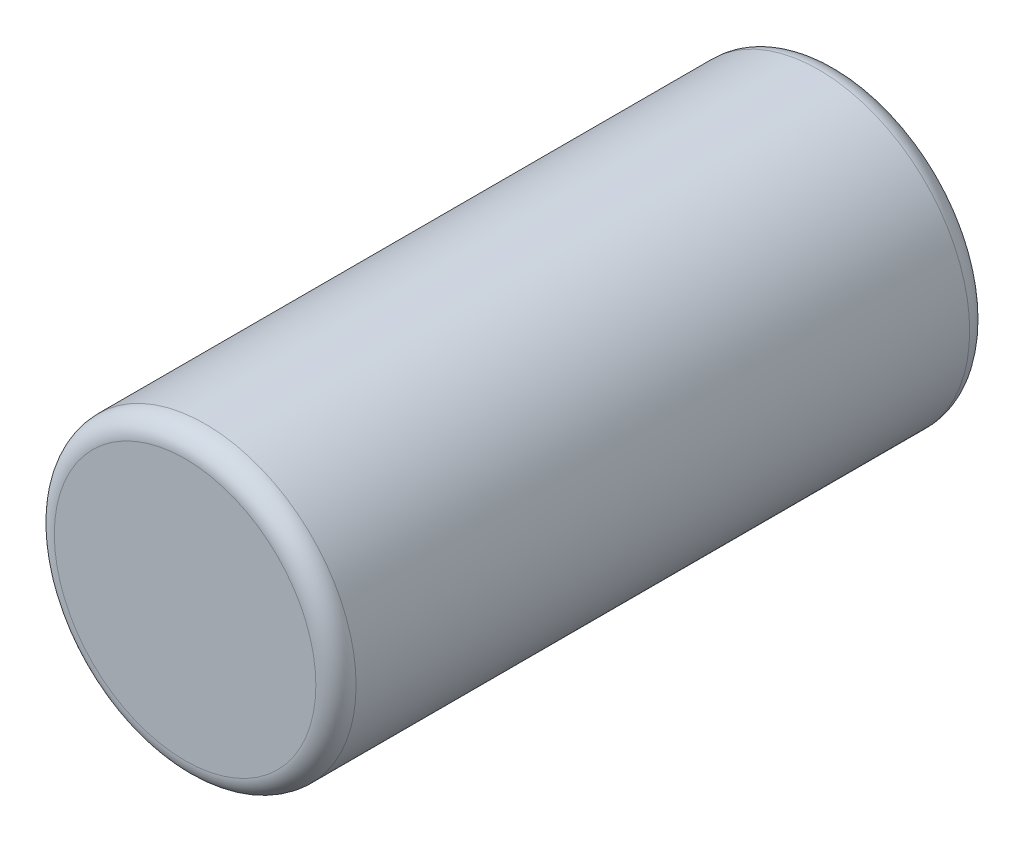
ISO-10303-21;
HEADER;
FILE_DESCRIPTION(('STEP AP214'),'2;1');
FILE_NAME('part.step','',(''),(''),'','','');
FILE_SCHEMA(('AUTOMOTIVE_DESIGN { 1 0 10303 214 1 1 1 1 }'));
ENDSEC;
DATA;
#1=APPLICATION_CONTEXT('core data for automotive mechanical design processes');
#2=APPLICATION_PROTOCOL_DEFINITION('international standard','automotive_design',2000,#1);
#3=PRODUCT_CONTEXT('',#1,'mechanical');
#4=PRODUCT('Part','Part','',(#3));
#5=PRODUCT_RELATED_PRODUCT_CATEGORY('part','',(#4));
#6=PRODUCT_DEFINITION_FORMATION('','',#4);
#7=PRODUCT_DEFINITION_CONTEXT('part definition',#1,'design');
#8=PRODUCT_DEFINITION('design','',#6,#7);
#9=PRODUCT_DEFINITION_SHAPE('','',#8);
#10=(LENGTH_UNIT() NAMED_UNIT(*) SI_UNIT(.MILLI.,.METRE.));
#11=(NAMED_UNIT(*) PLANE_ANGLE_UNIT() SI_UNIT($,.RADIAN.));
#12=(NAMED_UNIT(*) SI_UNIT($,.STERADIAN.) SOLID_ANGLE_UNIT());
#13=UNCERTAINTY_MEASURE_WITH_UNIT(LENGTH_MEASURE(1.E-05),#10,'distance_accuracy_value','');
#14=(GEOMETRIC_REPRESENTATION_CONTEXT(3) GLOBAL_UNCERTAINTY_ASSIGNED_CONTEXT((#13)) GLOBAL_UNIT_ASSIGNED_CONTEXT((#10,
#11,#12)) REPRESENTATION_CONTEXT('',''));
#15=CARTESIAN_POINT('',(0.,0.,0.));
#16=DIRECTION('',(0.,0.,1.));
#17=DIRECTION('',(1.,0.,0.));
#18=AXIS2_PLACEMENT_3D('',#15,#16,#17);
#19=CARTESIAN_POINT('',(0.,0.,6.5));
#20=DIRECTION('',(0.,0.,-1.));
#21=DIRECTION('',(-1.,0.,0.));
#22=AXIS2_PLACEMENT_3D('',#19,#20,#21);
#23=CYLINDRICAL_SURFACE('',#22,1.5);
#24=CARTESIAN_POINT('',(0.,0.,0.2));
#25=DIRECTION('',(0.,0.,1.));
#26=DIRECTION('',(1.,0.,0.));
#27=AXIS2_PLACEMENT_3D('',#24,#25,#26);
#28=CIRCLE('',#27,1.5);
#29=CARTESIAN_POINT('',(1.5,0.,0.2));
#30=VERTEX_POINT('',#29);
#31=EDGE_CURVE('E48',#30,#30,#28,.T.);
#32=ORIENTED_EDGE('',*,*,#31,.T.);
#33=EDGE_LOOP('',(#32));
#34=FACE_BOUND('',#33,.T.);
#35=CARTESIAN_POINT('',(0.,0.,6.3));
#36=DIRECTION('',(0.,0.,1.));
#37=DIRECTION('',(1.,0.,0.));
#38=AXIS2_PLACEMENT_3D('',#35,#36,#37);
#39=CIRCLE('',#38,1.5);
#40=CARTESIAN_POINT('',(1.5,0.,6.3));
#41=VERTEX_POINT('',#40);
#42=EDGE_CURVE('E52',#41,#41,#39,.F.);
#43=ORIENTED_EDGE('',*,*,#42,.T.);
#44=EDGE_LOOP('',(#43));
#45=FACE_BOUND('',#44,.T.);
#46=ADVANCED_FACE('F37',(#34,#45),#23,.T.);
#47=CARTESIAN_POINT('',(0.,0.,6.5));
#48=DIRECTION('',(0.,0.,1.));
#49=DIRECTION('',(1.,0.,0.));
#50=AXIS2_PLACEMENT_3D('',#47,#48,#49);
#51=PLANE('',#50);
#52=CARTESIAN_POINT('',(0.,0.,6.5));
#53=DIRECTION('',(0.,0.,1.));
#54=DIRECTION('',(1.,0.,0.));
#55=AXIS2_PLACEMENT_3D('',#52,#53,#54);
#56=CIRCLE('',#55,1.3);
#57=CARTESIAN_POINT('',(1.3,0.,6.5));
#58=VERTEX_POINT('',#57);
#59=EDGE_CURVE('E10',#58,#58,#56,.T.);
#60=ORIENTED_EDGE('',*,*,#59,.T.);
#61=EDGE_LOOP('',(#60));
#62=FACE_BOUND('',#61,.T.);
#63=ADVANCED_FACE('F68',(#62),#51,.T.);
#64=CARTESIAN_POINT('',(0.,0.,0.));
#65=DIRECTION('',(0.,0.,1.));
#66=DIRECTION('',(1.,0.,0.));
#67=AXIS2_PLACEMENT_3D('',#64,#65,#66);
#68=PLANE('',#67);
#69=CARTESIAN_POINT('',(0.,0.,0.));
#70=DIRECTION('',(0.,0.,1.));
#71=DIRECTION('',(1.,0.,0.));
#72=AXIS2_PLACEMENT_3D('',#69,#70,#71);
#73=CIRCLE('',#72,1.3);
#74=CARTESIAN_POINT('',(1.3,0.,0.));
#75=VERTEX_POINT('',#74);
#76=EDGE_CURVE('E44',#75,#75,#73,.F.);
#77=ORIENTED_EDGE('',*,*,#76,.T.);
#78=EDGE_LOOP('',(#77));
#79=FACE_BOUND('',#78,.T.);
#80=ADVANCED_FACE('F65',(#79),#68,.F.);
#81=CARTESIAN_POINT('',(0.,0.,0.2));
#82=DIRECTION('',(0.,0.,1.));
#83=DIRECTION('',(1.,0.,0.));
#84=AXIS2_PLACEMENT_3D('',#81,#82,#83);
#85=TOROIDAL_SURFACE('',#84,1.3,0.2);
#86=ORIENTED_EDGE('',*,*,#76,.F.);
#87=EDGE_LOOP('',(#86));
#88=FACE_BOUND('',#87,.T.);
#89=ORIENTED_EDGE('',*,*,#31,.F.);
#90=EDGE_LOOP('',(#89));
#91=FACE_BOUND('',#90,.T.);
#92=ADVANCED_FACE('F61',(#88,#91),#85,.T.);
#93=CARTESIAN_POINT('',(0.,0.,6.3));
#94=DIRECTION('',(0.,0.,1.));
#95=DIRECTION('',(1.,0.,0.));
#96=AXIS2_PLACEMENT_3D('',#93,#94,#95);
#97=TOROIDAL_SURFACE('',#96,1.3,0.2);
#98=ORIENTED_EDGE('',*,*,#42,.F.);
#99=EDGE_LOOP('',(#98));
#100=FACE_BOUND('',#99,.T.);
#101=ORIENTED_EDGE('',*,*,#59,.F.);
#102=EDGE_LOOP('',(#101));
#103=FACE_BOUND('',#102,.T.);
#104=ADVANCED_FACE('F39',(#100,#103),#97,.T.);
#105=CLOSED_SHELL('',(#46,#63,#80,#92,#104));
#106=MANIFOLD_SOLID_BREP('B2',#105);
#107=ADVANCED_BREP_SHAPE_REPRESENTATION('',(#18,#106),#14);
#108=SHAPE_DEFINITION_REPRESENTATION(#9,#107);
ENDSEC;
END-ISO-10303-21;
